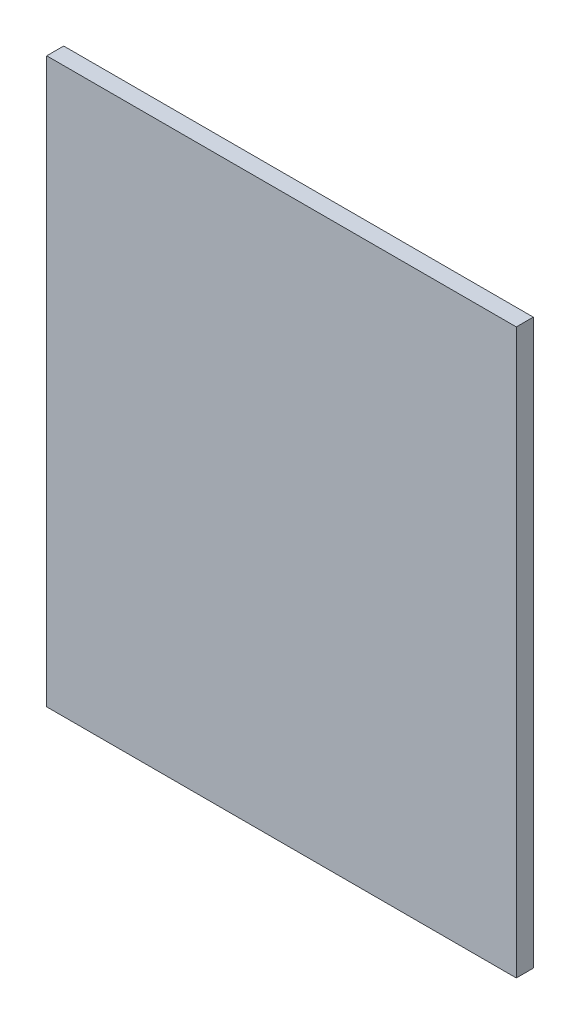
ISO-10303-21;
HEADER;
FILE_DESCRIPTION(('STEP AP214'),'2;1');
FILE_NAME('part.step','',(''),(''),'','','');
FILE_SCHEMA(('AUTOMOTIVE_DESIGN { 1 0 10303 214 1 1 1 1 }'));
ENDSEC;
DATA;
#1=APPLICATION_CONTEXT('core data for automotive mechanical design processes');
#2=APPLICATION_PROTOCOL_DEFINITION('international standard','automotive_design',2000,#1);
#3=PRODUCT_CONTEXT('',#1,'mechanical');
#4=PRODUCT('Part','Part','',(#3));
#5=PRODUCT_RELATED_PRODUCT_CATEGORY('part','',(#4));
#6=PRODUCT_DEFINITION_FORMATION('','',#4);
#7=PRODUCT_DEFINITION_CONTEXT('part definition',#1,'design');
#8=PRODUCT_DEFINITION('design','',#6,#7);
#9=PRODUCT_DEFINITION_SHAPE('','',#8);
#10=(LENGTH_UNIT() NAMED_UNIT(*) SI_UNIT(.MILLI.,.METRE.));
#11=(NAMED_UNIT(*) PLANE_ANGLE_UNIT() SI_UNIT($,.RADIAN.));
#12=(NAMED_UNIT(*) SI_UNIT($,.STERADIAN.) SOLID_ANGLE_UNIT());
#13=UNCERTAINTY_MEASURE_WITH_UNIT(LENGTH_MEASURE(1.E-05),#10,'distance_accuracy_value','');
#14=(GEOMETRIC_REPRESENTATION_CONTEXT(3) GLOBAL_UNCERTAINTY_ASSIGNED_CONTEXT((#13)) GLOBAL_UNIT_ASSIGNED_CONTEXT((#10,
#11,#12)) REPRESENTATION_CONTEXT('',''));
#15=CARTESIAN_POINT('',(0.,0.,0.));
#16=DIRECTION('',(0.,0.,1.));
#17=DIRECTION('',(1.,0.,0.));
#18=AXIS2_PLACEMENT_3D('',#15,#16,#17);
#19=CARTESIAN_POINT('',(-249.,-299.,18.));
#20=DIRECTION('',(1.,0.,0.));
#21=DIRECTION('',(0.,0.,-1.));
#22=AXIS2_PLACEMENT_3D('',#19,#20,#21);
#23=PLANE('',#22);
#24=DIRECTION('',(0.,-1.,0.));
#25=VECTOR('',#24,1.);
#26=CARTESIAN_POINT('',(-249.,-299.,0.));
#27=LINE('',#26,#25);
#28=CARTESIAN_POINT('',(-249.,299.,0.));
#29=VERTEX_POINT('',#28);
#30=CARTESIAN_POINT('',(-249.,-299.,0.));
#31=VERTEX_POINT('',#30);
#32=EDGE_CURVE('E95',#29,#31,#27,.T.);
#33=ORIENTED_EDGE('',*,*,#32,.T.);
#34=DIRECTION('',(0.,0.,-1.));
#35=VECTOR('',#34,1.);
#36=CARTESIAN_POINT('',(-249.,-299.,18.));
#37=LINE('',#36,#35);
#38=CARTESIAN_POINT('',(-249.,-299.,18.));
#39=VERTEX_POINT('',#38);
#40=EDGE_CURVE('E11',#39,#31,#37,.T.);
#41=ORIENTED_EDGE('',*,*,#40,.F.);
#42=DIRECTION('',(0.,-1.,0.));
#43=VECTOR('',#42,1.);
#44=CARTESIAN_POINT('',(-249.,-299.,18.));
#45=LINE('',#44,#43);
#46=CARTESIAN_POINT('',(-249.,299.,18.));
#47=VERTEX_POINT('',#46);
#48=EDGE_CURVE('E83',#47,#39,#45,.T.);
#49=ORIENTED_EDGE('',*,*,#48,.F.);
#50=DIRECTION('',(0.,0.,-1.));
#51=VECTOR('',#50,1.);
#52=CARTESIAN_POINT('',(-249.,299.,18.));
#53=LINE('',#52,#51);
#54=EDGE_CURVE('E91',#47,#29,#53,.T.);
#55=ORIENTED_EDGE('',*,*,#54,.T.);
#56=EDGE_LOOP('',(#33,#41,#49,#55));
#57=FACE_BOUND('',#56,.T.);
#58=ADVANCED_FACE('F32',(#57),#23,.F.);
#59=CARTESIAN_POINT('',(249.,-299.,18.));
#60=DIRECTION('',(0.,1.,0.));
#61=DIRECTION('',(-1.,0.,0.));
#62=AXIS2_PLACEMENT_3D('',#59,#60,#61);
#63=PLANE('',#62);
#64=DIRECTION('',(1.,0.,0.));
#65=VECTOR('',#64,1.);
#66=CARTESIAN_POINT('',(249.,-299.,0.));
#67=LINE('',#66,#65);
#68=CARTESIAN_POINT('',(249.,-299.,0.));
#69=VERTEX_POINT('',#68);
#70=EDGE_CURVE('E87',#31,#69,#67,.T.);
#71=ORIENTED_EDGE('',*,*,#70,.T.);
#72=DIRECTION('',(0.,0.,-1.));
#73=VECTOR('',#72,1.);
#74=CARTESIAN_POINT('',(249.,-299.,18.));
#75=LINE('',#74,#73);
#76=CARTESIAN_POINT('',(249.,-299.,18.));
#77=VERTEX_POINT('',#76);
#78=EDGE_CURVE('E40',#77,#69,#75,.T.);
#79=ORIENTED_EDGE('',*,*,#78,.F.);
#80=DIRECTION('',(1.,0.,0.));
#81=VECTOR('',#80,1.);
#82=CARTESIAN_POINT('',(249.,-299.,18.));
#83=LINE('',#82,#81);
#84=EDGE_CURVE('E78',#39,#77,#83,.T.);
#85=ORIENTED_EDGE('',*,*,#84,.F.);
#86=ORIENTED_EDGE('',*,*,#40,.T.);
#87=EDGE_LOOP('',(#71,#79,#85,#86));
#88=FACE_BOUND('',#87,.T.);
#89=ADVANCED_FACE('F86',(#88),#63,.F.);
#90=CARTESIAN_POINT('',(249.,-299.,18.));
#91=DIRECTION('',(-1.,0.,0.));
#92=DIRECTION('',(0.,0.,1.));
#93=AXIS2_PLACEMENT_3D('',#90,#91,#92);
#94=PLANE('',#93);
#95=DIRECTION('',(0.,1.,0.));
#96=VECTOR('',#95,1.);
#97=CARTESIAN_POINT('',(249.,-299.,0.));
#98=LINE('',#97,#96);
#99=CARTESIAN_POINT('',(249.,299.,0.));
#100=VERTEX_POINT('',#99);
#101=EDGE_CURVE('E65',#69,#100,#98,.T.);
#102=ORIENTED_EDGE('',*,*,#101,.T.);
#103=DIRECTION('',(0.,0.,-1.));
#104=VECTOR('',#103,1.);
#105=CARTESIAN_POINT('',(249.,299.,18.));
#106=LINE('',#105,#104);
#107=CARTESIAN_POINT('',(249.,299.,18.));
#108=VERTEX_POINT('',#107);
#109=EDGE_CURVE('E88',#108,#100,#106,.T.);
#110=ORIENTED_EDGE('',*,*,#109,.F.);
#111=DIRECTION('',(0.,1.,0.));
#112=VECTOR('',#111,1.);
#113=CARTESIAN_POINT('',(249.,-299.,18.));
#114=LINE('',#113,#112);
#115=EDGE_CURVE('E81',#77,#108,#114,.T.);
#116=ORIENTED_EDGE('',*,*,#115,.F.);
#117=ORIENTED_EDGE('',*,*,#78,.T.);
#118=EDGE_LOOP('',(#102,#110,#116,#117));
#119=FACE_BOUND('',#118,.T.);
#120=ADVANCED_FACE('F89',(#119),#94,.F.);
#121=CARTESIAN_POINT('',(249.,299.,18.));
#122=DIRECTION('',(0.,-1.,0.));
#123=DIRECTION('',(1.,0.,0.));
#124=AXIS2_PLACEMENT_3D('',#121,#122,#123);
#125=PLANE('',#124);
#126=DIRECTION('',(-1.,0.,0.));
#127=VECTOR('',#126,1.);
#128=CARTESIAN_POINT('',(249.,299.,0.));
#129=LINE('',#128,#127);
#130=EDGE_CURVE('E71',#100,#29,#129,.T.);
#131=ORIENTED_EDGE('',*,*,#130,.T.);
#132=ORIENTED_EDGE('',*,*,#54,.F.);
#133=DIRECTION('',(-1.,0.,0.));
#134=VECTOR('',#133,1.);
#135=CARTESIAN_POINT('',(249.,299.,18.));
#136=LINE('',#135,#134);
#137=EDGE_CURVE('E48',#108,#47,#136,.T.);
#138=ORIENTED_EDGE('',*,*,#137,.F.);
#139=ORIENTED_EDGE('',*,*,#109,.T.);
#140=EDGE_LOOP('',(#131,#132,#138,#139));
#141=FACE_BOUND('',#140,.T.);
#142=ADVANCED_FACE('F102',(#141),#125,.F.);
#143=CARTESIAN_POINT('',(0.,0.,18.));
#144=DIRECTION('',(0.,0.,1.));
#145=DIRECTION('',(1.,0.,0.));
#146=AXIS2_PLACEMENT_3D('',#143,#144,#145);
#147=PLANE('',#146);
#148=ORIENTED_EDGE('',*,*,#48,.T.);
#149=ORIENTED_EDGE('',*,*,#84,.T.);
#150=ORIENTED_EDGE('',*,*,#115,.T.);
#151=ORIENTED_EDGE('',*,*,#137,.T.);
#152=EDGE_LOOP('',(#148,#149,#150,#151));
#153=FACE_BOUND('',#152,.T.);
#154=ADVANCED_FACE('F79',(#153),#147,.T.);
#155=CARTESIAN_POINT('',(0.,0.,0.));
#156=DIRECTION('',(0.,0.,1.));
#157=DIRECTION('',(1.,0.,0.));
#158=AXIS2_PLACEMENT_3D('',#155,#156,#157);
#159=PLANE('',#158);
#160=ORIENTED_EDGE('',*,*,#32,.F.);
#161=ORIENTED_EDGE('',*,*,#130,.F.);
#162=ORIENTED_EDGE('',*,*,#101,.F.);
#163=ORIENTED_EDGE('',*,*,#70,.F.);
#164=EDGE_LOOP('',(#160,#161,#162,#163));
#165=FACE_BOUND('',#164,.T.);
#166=ADVANCED_FACE('F105',(#165),#159,.F.);
#167=CLOSED_SHELL('',(#58,#89,#120,#142,#154,#166));
#168=MANIFOLD_SOLID_BREP('B2',#167);
#169=ADVANCED_BREP_SHAPE_REPRESENTATION('',(#18,#168),#14);
#170=SHAPE_DEFINITION_REPRESENTATION(#9,#169);
ENDSEC;
END-ISO-10303-21;
